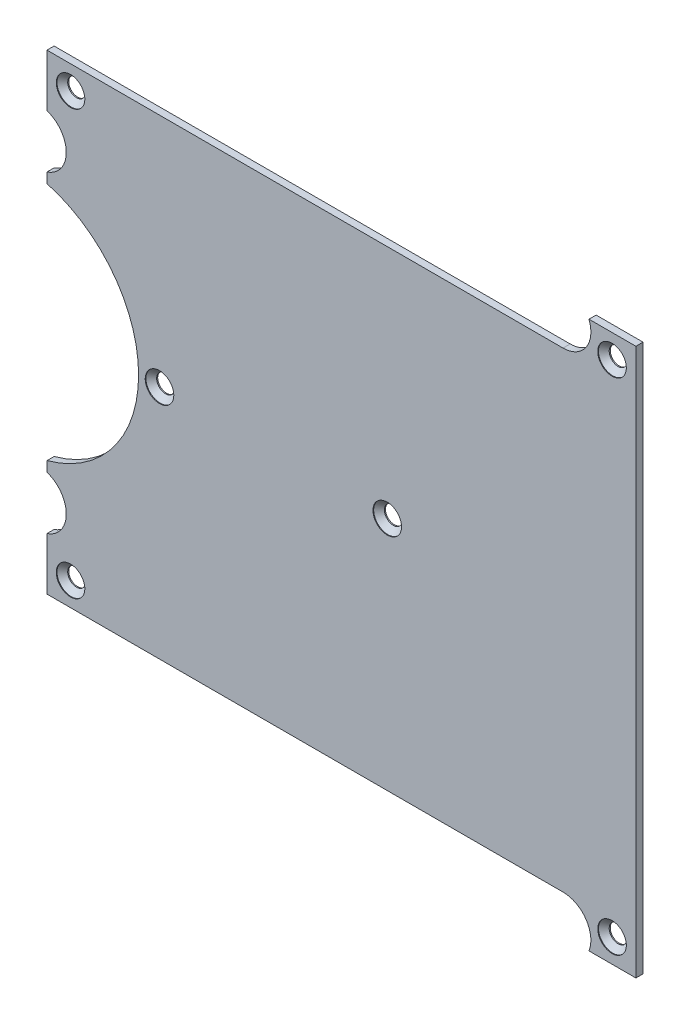
ISO-10303-21;
HEADER;
FILE_DESCRIPTION(('STEP AP214'),'2;1');
FILE_NAME('part.step','',(''),(''),'','','');
FILE_SCHEMA(('AUTOMOTIVE_DESIGN { 1 0 10303 214 1 1 1 1 }'));
ENDSEC;
DATA;
#1=APPLICATION_CONTEXT('core data for automotive mechanical design processes');
#2=APPLICATION_PROTOCOL_DEFINITION('international standard','automotive_design',2000,#1);
#3=PRODUCT_CONTEXT('',#1,'mechanical');
#4=PRODUCT('Part','Part','',(#3));
#5=PRODUCT_RELATED_PRODUCT_CATEGORY('part','',(#4));
#6=PRODUCT_DEFINITION_FORMATION('','',#4);
#7=PRODUCT_DEFINITION_CONTEXT('part definition',#1,'design');
#8=PRODUCT_DEFINITION('design','',#6,#7);
#9=PRODUCT_DEFINITION_SHAPE('','',#8);
#10=(LENGTH_UNIT() NAMED_UNIT(*) SI_UNIT(.MILLI.,.METRE.));
#11=(NAMED_UNIT(*) PLANE_ANGLE_UNIT() SI_UNIT($,.RADIAN.));
#12=(NAMED_UNIT(*) SI_UNIT($,.STERADIAN.) SOLID_ANGLE_UNIT());
#13=UNCERTAINTY_MEASURE_WITH_UNIT(LENGTH_MEASURE(1.E-05),#10,'distance_accuracy_value','');
#14=(GEOMETRIC_REPRESENTATION_CONTEXT(3) GLOBAL_UNCERTAINTY_ASSIGNED_CONTEXT((#13)) GLOBAL_UNIT_ASSIGNED_CONTEXT((#10,
#11,#12)) REPRESENTATION_CONTEXT('',''));
#15=CARTESIAN_POINT('',(0.,0.,0.));
#16=DIRECTION('',(0.,0.,1.));
#17=DIRECTION('',(1.,0.,0.));
#18=AXIS2_PLACEMENT_3D('',#15,#16,#17);
#19=CARTESIAN_POINT('',(0.,-36.88,1.));
#20=DIRECTION('',(0.,0.,1.));
#21=DIRECTION('',(1.,0.,0.));
#22=AXIS2_PLACEMENT_3D('',#19,#20,#21);
#23=PLANE('',#22);
#24=CARTESIAN_POINT('',(-68.9520251592834,29.68,1.));
#25=DIRECTION('',(0.,0.,1.));
#26=DIRECTION('',(1.,0.,0.));
#27=AXIS2_PLACEMENT_3D('',#24,#25,#26);
#28=CIRCLE('',#27,2.);
#29=CARTESIAN_POINT('',(-66.9520251592834,29.68,1.));
#30=VERTEX_POINT('',#29);
#31=EDGE_CURVE('E488',#30,#30,#28,.T.);
#32=ORIENTED_EDGE('',*,*,#31,.F.);
#33=EDGE_LOOP('',(#32));
#34=FACE_BOUND('',#33,.T.);
#35=CARTESIAN_POINT('',(6.86324983090334,35.,1.));
#36=DIRECTION('',(0.,0.,1.));
#37=DIRECTION('',(1.,0.,0.));
#38=AXIS2_PLACEMENT_3D('',#35,#36,#37);
#39=CIRCLE('',#38,2.);
#40=CARTESIAN_POINT('',(8.86324983090334,35.,1.));
#41=VERTEX_POINT('',#40);
#42=EDGE_CURVE('E296',#41,#41,#39,.T.);
#43=ORIENTED_EDGE('',*,*,#42,.F.);
#44=EDGE_LOOP('',(#43));
#45=FACE_BOUND('',#44,.T.);
#46=CARTESIAN_POINT('',(6.86324983090334,-35.,1.));
#47=DIRECTION('',(0.,0.,1.));
#48=DIRECTION('',(1.,0.,0.));
#49=AXIS2_PLACEMENT_3D('',#46,#47,#48);
#50=CIRCLE('',#49,2.);
#51=CARTESIAN_POINT('',(8.86324983090334,-35.,1.));
#52=VERTEX_POINT('',#51);
#53=EDGE_CURVE('E287',#52,#52,#50,.T.);
#54=ORIENTED_EDGE('',*,*,#53,.F.);
#55=EDGE_LOOP('',(#54));
#56=FACE_BOUND('',#55,.T.);
#57=CARTESIAN_POINT('',(-68.9520251592834,-29.68,1.));
#58=DIRECTION('',(0.,0.,1.));
#59=DIRECTION('',(1.,0.,0.));
#60=AXIS2_PLACEMENT_3D('',#57,#58,#59);
#61=CIRCLE('',#60,2.);
#62=CARTESIAN_POINT('',(-66.9520251592834,-29.68,1.));
#63=VERTEX_POINT('',#62);
#64=EDGE_CURVE('E282',#63,#63,#61,.T.);
#65=ORIENTED_EDGE('',*,*,#64,.F.);
#66=EDGE_LOOP('',(#65));
#67=FACE_BOUND('',#66,.T.);
#68=CARTESIAN_POINT('',(-56.4970251592834,0.,1.));
#69=DIRECTION('',(0.,0.,1.));
#70=DIRECTION('',(1.,0.,0.));
#71=AXIS2_PLACEMENT_3D('',#68,#69,#70);
#72=CIRCLE('',#71,2.);
#73=CARTESIAN_POINT('',(-54.4970251592834,0.,1.));
#74=VERTEX_POINT('',#73);
#75=EDGE_CURVE('E277',#74,#74,#72,.T.);
#76=ORIENTED_EDGE('',*,*,#75,.F.);
#77=EDGE_LOOP('',(#76));
#78=FACE_BOUND('',#77,.T.);
#79=CARTESIAN_POINT('',(-24.6110125796417,0.,1.));
#80=DIRECTION('',(0.,0.,1.));
#81=DIRECTION('',(1.,0.,0.));
#82=AXIS2_PLACEMENT_3D('',#79,#80,#81);
#83=CIRCLE('',#82,2.);
#84=CARTESIAN_POINT('',(-22.6110125796417,0.,1.));
#85=VERTEX_POINT('',#84);
#86=EDGE_CURVE('E271',#85,#85,#83,.T.);
#87=ORIENTED_EDGE('',*,*,#86,.F.);
#88=EDGE_LOOP('',(#87));
#89=FACE_BOUND('',#88,.T.);
#90=CARTESIAN_POINT('',(0.,-36.88,1.));
#91=DIRECTION('',(0.,0.,-1.));
#92=DIRECTION('',(1.,0.,0.));
#93=AXIS2_PLACEMENT_3D('',#90,#91,#92);
#94=CIRCLE('',#93,3.90000000000011);
#95=CARTESIAN_POINT('',(0.,-32.98,1.));
#96=VERTEX_POINT('',#95);
#97=CARTESIAN_POINT('',(3.63229954711911,-38.3,1.));
#98=VERTEX_POINT('',#97);
#99=EDGE_CURVE('E219',#96,#98,#94,.T.);
#100=ORIENTED_EDGE('',*,*,#99,.T.);
#101=DIRECTION('',(1.,0.,0.));
#102=VECTOR('',#101,1.);
#103=CARTESIAN_POINT('',(3.63229954711911,-38.3,1.));
#104=LINE('',#103,#102);
#105=CARTESIAN_POINT('',(10.2,-38.3,1.));
#106=VERTEX_POINT('',#105);
#107=EDGE_CURVE('E120',#98,#106,#104,.T.);
#108=ORIENTED_EDGE('',*,*,#107,.T.);
#109=DIRECTION('',(0.,1.,0.));
#110=VECTOR('',#109,1.);
#111=CARTESIAN_POINT('',(10.2,-38.3,1.));
#112=LINE('',#111,#110);
#113=CARTESIAN_POINT('',(10.2,38.3,1.));
#114=VERTEX_POINT('',#113);
#115=EDGE_CURVE('E352',#106,#114,#112,.T.);
#116=ORIENTED_EDGE('',*,*,#115,.T.);
#117=DIRECTION('',(-1.,0.,0.));
#118=VECTOR('',#117,1.);
#119=CARTESIAN_POINT('',(10.2,38.3,1.));
#120=LINE('',#119,#118);
#121=CARTESIAN_POINT('',(3.63229954711911,38.3,1.));
#122=VERTEX_POINT('',#121);
#123=EDGE_CURVE('E355',#114,#122,#120,.T.);
#124=ORIENTED_EDGE('',*,*,#123,.T.);
#125=CARTESIAN_POINT('',(0.,36.88,1.));
#126=DIRECTION('',(0.,0.,-1.));
#127=DIRECTION('',(1.,0.,0.));
#128=AXIS2_PLACEMENT_3D('',#125,#126,#127);
#129=CIRCLE('',#128,3.90000000000011);
#130=CARTESIAN_POINT('',(0.,32.9799999999999,1.));
#131=VERTEX_POINT('',#130);
#132=EDGE_CURVE('E358',#122,#131,#129,.T.);
#133=ORIENTED_EDGE('',*,*,#132,.T.);
#134=DIRECTION('',(-1.,0.,0.));
#135=VECTOR('',#134,1.);
#136=CARTESIAN_POINT('',(0.,32.98,1.));
#137=LINE('',#136,#135);
#138=CARTESIAN_POINT('',(-72.2520251592834,32.98,1.));
#139=VERTEX_POINT('',#138);
#140=EDGE_CURVE('E361',#131,#139,#137,.T.);
#141=ORIENTED_EDGE('',*,*,#140,.T.);
#142=DIRECTION('',(0.,-1.,0.));
#143=VECTOR('',#142,1.);
#144=CARTESIAN_POINT('',(-72.2520251592834,32.98,1.));
#145=LINE('',#144,#143);
#146=CARTESIAN_POINT('',(-72.2520251592834,25.6307950630559,1.));
#147=VERTEX_POINT('',#146);
#148=EDGE_CURVE('E364',#139,#147,#145,.T.);
#149=ORIENTED_EDGE('',*,*,#148,.T.);
#150=CARTESIAN_POINT('',(-73.4520251592834,21.92,1.));
#151=DIRECTION('',(0.,0.,-1.));
#152=DIRECTION('',(1.,0.,0.));
#153=AXIS2_PLACEMENT_3D('',#150,#151,#152);
#154=CIRCLE('',#153,3.89999999999999);
#155=CARTESIAN_POINT('',(-72.2520251592834,18.2092049369441,1.));
#156=VERTEX_POINT('',#155);
#157=EDGE_CURVE('E367',#147,#156,#154,.T.);
#158=ORIENTED_EDGE('',*,*,#157,.T.);
#159=DIRECTION('',(0.,-1.,0.));
#160=VECTOR('',#159,1.);
#161=CARTESIAN_POINT('',(-72.2520251592834,18.2092049369441,1.));
#162=LINE('',#161,#160);
#163=CARTESIAN_POINT('',(-72.2520251592834,16.7891363684973,1.));
#164=VERTEX_POINT('',#163);
#165=EDGE_CURVE('E370',#156,#164,#162,.T.);
#166=ORIENTED_EDGE('',*,*,#165,.T.);
#167=CARTESIAN_POINT('',(-76.8220251592834,0.,1.));
#168=DIRECTION('',(0.,0.,-1.));
#169=DIRECTION('',(1.,0.,0.));
#170=AXIS2_PLACEMENT_3D('',#167,#168,#169);
#171=CIRCLE('',#170,17.4);
#172=CARTESIAN_POINT('',(-72.2520251592834,-16.7891363684973,1.));
#173=VERTEX_POINT('',#172);
#174=EDGE_CURVE('E373',#164,#173,#171,.T.);
#175=ORIENTED_EDGE('',*,*,#174,.T.);
#176=DIRECTION('',(0.,-1.,0.));
#177=VECTOR('',#176,1.);
#178=CARTESIAN_POINT('',(-72.2520251592834,-16.7891363684973,1.));
#179=LINE('',#178,#177);
#180=CARTESIAN_POINT('',(-72.2520251592834,-18.2092049369441,1.));
#181=VERTEX_POINT('',#180);
#182=EDGE_CURVE('E156',#173,#181,#179,.T.);
#183=ORIENTED_EDGE('',*,*,#182,.T.);
#184=CARTESIAN_POINT('',(-73.4520251592834,-21.92,1.));
#185=DIRECTION('',(0.,0.,-1.));
#186=DIRECTION('',(1.,0.,0.));
#187=AXIS2_PLACEMENT_3D('',#184,#185,#186);
#188=CIRCLE('',#187,3.89999999999999);
#189=CARTESIAN_POINT('',(-72.2520251592834,-25.6307950630559,1.));
#190=VERTEX_POINT('',#189);
#191=EDGE_CURVE('E151',#181,#190,#188,.T.);
#192=ORIENTED_EDGE('',*,*,#191,.T.);
#193=DIRECTION('',(0.,-1.,0.));
#194=VECTOR('',#193,1.);
#195=CARTESIAN_POINT('',(-72.2520251592834,-25.6307950630559,1.));
#196=LINE('',#195,#194);
#197=CARTESIAN_POINT('',(-72.2520251592834,-32.98,1.));
#198=VERTEX_POINT('',#197);
#199=EDGE_CURVE('E154',#190,#198,#196,.T.);
#200=ORIENTED_EDGE('',*,*,#199,.T.);
#201=DIRECTION('',(1.,0.,0.));
#202=VECTOR('',#201,1.);
#203=CARTESIAN_POINT('',(-72.2520251592834,-32.98,1.));
#204=LINE('',#203,#202);
#205=EDGE_CURVE('E59',#198,#96,#204,.T.);
#206=ORIENTED_EDGE('',*,*,#205,.T.);
#207=EDGE_LOOP('',(#100,#108,#116,#124,#133,#141,#149,#158,#166,#175,#183,#192,#200,#206));
#208=FACE_BOUND('',#207,.T.);
#209=ADVANCED_FACE('F39',(#34,#45,#56,#67,#78,#89,#208),#23,.T.);
#210=CARTESIAN_POINT('',(0.,-36.88,0.));
#211=DIRECTION('',(0.,0.,1.));
#212=DIRECTION('',(1.,0.,0.));
#213=AXIS2_PLACEMENT_3D('',#210,#211,#212);
#214=PLANE('',#213);
#215=CARTESIAN_POINT('',(0.,-36.88,0.));
#216=DIRECTION('',(0.,0.,-1.));
#217=DIRECTION('',(1.,0.,0.));
#218=AXIS2_PLACEMENT_3D('',#215,#216,#217);
#219=CIRCLE('',#218,3.90000000000011);
#220=CARTESIAN_POINT('',(0.,-32.98,0.));
#221=VERTEX_POINT('',#220);
#222=CARTESIAN_POINT('',(3.63229954711911,-38.3,0.));
#223=VERTEX_POINT('',#222);
#224=EDGE_CURVE('E178',#221,#223,#219,.T.);
#225=ORIENTED_EDGE('',*,*,#224,.F.);
#226=DIRECTION('',(1.,0.,0.));
#227=VECTOR('',#226,1.);
#228=CARTESIAN_POINT('',(-72.2520251592834,-32.98,0.));
#229=LINE('',#228,#227);
#230=CARTESIAN_POINT('',(-72.2520251592834,-32.98,0.));
#231=VERTEX_POINT('',#230);
#232=EDGE_CURVE('E112',#231,#221,#229,.T.);
#233=ORIENTED_EDGE('',*,*,#232,.F.);
#234=DIRECTION('',(0.,-1.,0.));
#235=VECTOR('',#234,1.);
#236=CARTESIAN_POINT('',(-72.2520251592834,-25.6307950630559,0.));
#237=LINE('',#236,#235);
#238=CARTESIAN_POINT('',(-72.2520251592834,-25.6307950630559,0.));
#239=VERTEX_POINT('',#238);
#240=EDGE_CURVE('E106',#239,#231,#237,.T.);
#241=ORIENTED_EDGE('',*,*,#240,.F.);
#242=CARTESIAN_POINT('',(-73.4520251592834,-21.92,0.));
#243=DIRECTION('',(0.,0.,-1.));
#244=DIRECTION('',(1.,0.,0.));
#245=AXIS2_PLACEMENT_3D('',#242,#243,#244);
#246=CIRCLE('',#245,3.89999999999999);
#247=CARTESIAN_POINT('',(-72.2520251592834,-18.2092049369441,0.));
#248=VERTEX_POINT('',#247);
#249=EDGE_CURVE('E165',#248,#239,#246,.T.);
#250=ORIENTED_EDGE('',*,*,#249,.F.);
#251=DIRECTION('',(0.,-1.,0.));
#252=VECTOR('',#251,1.);
#253=CARTESIAN_POINT('',(-72.2520251592834,-16.7891363684973,0.));
#254=LINE('',#253,#252);
#255=CARTESIAN_POINT('',(-72.2520251592834,-16.7891363684973,0.));
#256=VERTEX_POINT('',#255);
#257=EDGE_CURVE('E210',#256,#248,#254,.T.);
#258=ORIENTED_EDGE('',*,*,#257,.F.);
#259=CARTESIAN_POINT('',(-76.8220251592834,0.,0.));
#260=DIRECTION('',(0.,0.,-1.));
#261=DIRECTION('',(1.,0.,0.));
#262=AXIS2_PLACEMENT_3D('',#259,#260,#261);
#263=CIRCLE('',#262,17.4);
#264=CARTESIAN_POINT('',(-72.2520251592834,16.7891363684973,0.));
#265=VERTEX_POINT('',#264);
#266=EDGE_CURVE('E207',#265,#256,#263,.T.);
#267=ORIENTED_EDGE('',*,*,#266,.F.);
#268=DIRECTION('',(0.,-1.,0.));
#269=VECTOR('',#268,1.);
#270=CARTESIAN_POINT('',(-72.2520251592834,18.2092049369441,0.));
#271=LINE('',#270,#269);
#272=CARTESIAN_POINT('',(-72.2520251592834,18.2092049369441,0.));
#273=VERTEX_POINT('',#272);
#274=EDGE_CURVE('E204',#273,#265,#271,.T.);
#275=ORIENTED_EDGE('',*,*,#274,.F.);
#276=CARTESIAN_POINT('',(-73.4520251592834,21.92,0.));
#277=DIRECTION('',(0.,0.,-1.));
#278=DIRECTION('',(1.,0.,0.));
#279=AXIS2_PLACEMENT_3D('',#276,#277,#278);
#280=CIRCLE('',#279,3.89999999999999);
#281=CARTESIAN_POINT('',(-72.2520251592834,25.6307950630559,0.));
#282=VERTEX_POINT('',#281);
#283=EDGE_CURVE('E201',#282,#273,#280,.T.);
#284=ORIENTED_EDGE('',*,*,#283,.F.);
#285=DIRECTION('',(0.,-1.,0.));
#286=VECTOR('',#285,1.);
#287=CARTESIAN_POINT('',(-72.2520251592834,32.98,0.));
#288=LINE('',#287,#286);
#289=CARTESIAN_POINT('',(-72.2520251592834,32.98,0.));
#290=VERTEX_POINT('',#289);
#291=EDGE_CURVE('E198',#290,#282,#288,.T.);
#292=ORIENTED_EDGE('',*,*,#291,.F.);
#293=DIRECTION('',(-1.,0.,0.));
#294=VECTOR('',#293,1.);
#295=CARTESIAN_POINT('',(0.,32.98,0.));
#296=LINE('',#295,#294);
#297=CARTESIAN_POINT('',(0.,32.9799999999999,0.));
#298=VERTEX_POINT('',#297);
#299=EDGE_CURVE('E195',#298,#290,#296,.T.);
#300=ORIENTED_EDGE('',*,*,#299,.F.);
#301=CARTESIAN_POINT('',(0.,36.88,0.));
#302=DIRECTION('',(0.,0.,-1.));
#303=DIRECTION('',(1.,0.,0.));
#304=AXIS2_PLACEMENT_3D('',#301,#302,#303);
#305=CIRCLE('',#304,3.90000000000011);
#306=CARTESIAN_POINT('',(3.63229954711911,38.3,0.));
#307=VERTEX_POINT('',#306);
#308=EDGE_CURVE('E192',#307,#298,#305,.T.);
#309=ORIENTED_EDGE('',*,*,#308,.F.);
#310=DIRECTION('',(-1.,0.,0.));
#311=VECTOR('',#310,1.);
#312=CARTESIAN_POINT('',(10.2,38.3,0.));
#313=LINE('',#312,#311);
#314=CARTESIAN_POINT('',(10.2,38.3,0.));
#315=VERTEX_POINT('',#314);
#316=EDGE_CURVE('E189',#315,#307,#313,.T.);
#317=ORIENTED_EDGE('',*,*,#316,.F.);
#318=DIRECTION('',(0.,1.,0.));
#319=VECTOR('',#318,1.);
#320=CARTESIAN_POINT('',(10.2,-38.3,0.));
#321=LINE('',#320,#319);
#322=CARTESIAN_POINT('',(10.2,-38.3,0.));
#323=VERTEX_POINT('',#322);
#324=EDGE_CURVE('E186',#323,#315,#321,.T.);
#325=ORIENTED_EDGE('',*,*,#324,.F.);
#326=DIRECTION('',(1.,0.,0.));
#327=VECTOR('',#326,1.);
#328=CARTESIAN_POINT('',(3.63229954711911,-38.3,0.));
#329=LINE('',#328,#327);
#330=EDGE_CURVE('E182',#223,#323,#329,.T.);
#331=ORIENTED_EDGE('',*,*,#330,.F.);
#332=EDGE_LOOP('',(#225,#233,#241,#250,#258,#267,#275,#284,#292,#300,#309,#317,#325,#331));
#333=FACE_BOUND('',#332,.T.);
#334=CARTESIAN_POINT('',(-68.9520251592834,29.68,0.));
#335=DIRECTION('',(0.,0.,1.));
#336=DIRECTION('',(1.,0.,0.));
#337=AXIS2_PLACEMENT_3D('',#334,#335,#336);
#338=CIRCLE('',#337,1.25);
#339=CARTESIAN_POINT('',(-67.7020251592834,29.68,0.));
#340=VERTEX_POINT('',#339);
#341=EDGE_CURVE('E183',#340,#340,#338,.T.);
#342=ORIENTED_EDGE('',*,*,#341,.T.);
#343=EDGE_LOOP('',(#342));
#344=FACE_BOUND('',#343,.T.);
#345=CARTESIAN_POINT('',(6.86324983090334,35.,0.));
#346=DIRECTION('',(0.,0.,1.));
#347=DIRECTION('',(1.,0.,0.));
#348=AXIS2_PLACEMENT_3D('',#345,#346,#347);
#349=CIRCLE('',#348,1.25);
#350=CARTESIAN_POINT('',(8.11324983090334,35.,0.));
#351=VERTEX_POINT('',#350);
#352=EDGE_CURVE('E341',#351,#351,#349,.T.);
#353=ORIENTED_EDGE('',*,*,#352,.T.);
#354=EDGE_LOOP('',(#353));
#355=FACE_BOUND('',#354,.T.);
#356=CARTESIAN_POINT('',(6.86324983090334,-35.,0.));
#357=DIRECTION('',(0.,0.,1.));
#358=DIRECTION('',(1.,0.,0.));
#359=AXIS2_PLACEMENT_3D('',#356,#357,#358);
#360=CIRCLE('',#359,1.25);
#361=CARTESIAN_POINT('',(8.11324983090334,-35.,0.));
#362=VERTEX_POINT('',#361);
#363=EDGE_CURVE('E337',#362,#362,#360,.T.);
#364=ORIENTED_EDGE('',*,*,#363,.T.);
#365=EDGE_LOOP('',(#364));
#366=FACE_BOUND('',#365,.T.);
#367=CARTESIAN_POINT('',(-68.9520251592834,-29.68,0.));
#368=DIRECTION('',(0.,0.,1.));
#369=DIRECTION('',(1.,0.,0.));
#370=AXIS2_PLACEMENT_3D('',#367,#368,#369);
#371=CIRCLE('',#370,1.25);
#372=CARTESIAN_POINT('',(-67.7020251592834,-29.68,0.));
#373=VERTEX_POINT('',#372);
#374=EDGE_CURVE('E333',#373,#373,#371,.T.);
#375=ORIENTED_EDGE('',*,*,#374,.T.);
#376=EDGE_LOOP('',(#375));
#377=FACE_BOUND('',#376,.T.);
#378=CARTESIAN_POINT('',(-56.4970251592834,0.,0.));
#379=DIRECTION('',(0.,0.,1.));
#380=DIRECTION('',(1.,0.,0.));
#381=AXIS2_PLACEMENT_3D('',#378,#379,#380);
#382=CIRCLE('',#381,1.25);
#383=CARTESIAN_POINT('',(-55.2470251592834,0.,0.));
#384=VERTEX_POINT('',#383);
#385=EDGE_CURVE('E329',#384,#384,#382,.T.);
#386=ORIENTED_EDGE('',*,*,#385,.T.);
#387=EDGE_LOOP('',(#386));
#388=FACE_BOUND('',#387,.T.);
#389=CARTESIAN_POINT('',(-24.6110125796417,0.,0.));
#390=DIRECTION('',(0.,0.,1.));
#391=DIRECTION('',(1.,0.,0.));
#392=AXIS2_PLACEMENT_3D('',#389,#390,#391);
#393=CIRCLE('',#392,1.25);
#394=CARTESIAN_POINT('',(-23.3610125796417,0.,0.));
#395=VERTEX_POINT('',#394);
#396=EDGE_CURVE('E265',#395,#395,#393,.T.);
#397=ORIENTED_EDGE('',*,*,#396,.T.);
#398=EDGE_LOOP('',(#397));
#399=FACE_BOUND('',#398,.T.);
#400=ADVANCED_FACE('F388',(#333,#344,#355,#366,#377,#388,#399),#214,.F.);
#401=CARTESIAN_POINT('',(0.,-36.88,1.));
#402=DIRECTION('',(0.,0.,-1.));
#403=DIRECTION('',(-1.,0.,0.));
#404=AXIS2_PLACEMENT_3D('',#401,#402,#403);
#405=CYLINDRICAL_SURFACE('',#404,3.90000000000011);
#406=ORIENTED_EDGE('',*,*,#224,.T.);
#407=DIRECTION('',(0.,0.,-1.));
#408=VECTOR('',#407,1.);
#409=CARTESIAN_POINT('',(3.63229954711911,-38.3,1.));
#410=LINE('',#409,#408);
#411=EDGE_CURVE('E11',#98,#223,#410,.T.);
#412=ORIENTED_EDGE('',*,*,#411,.F.);
#413=ORIENTED_EDGE('',*,*,#99,.F.);
#414=DIRECTION('',(0.,0.,-1.));
#415=VECTOR('',#414,1.);
#416=CARTESIAN_POINT('',(0.,-32.98,1.));
#417=LINE('',#416,#415);
#418=EDGE_CURVE('E174',#96,#221,#417,.T.);
#419=ORIENTED_EDGE('',*,*,#418,.T.);
#420=EDGE_LOOP('',(#406,#412,#413,#419));
#421=FACE_BOUND('',#420,.T.);
#422=ADVANCED_FACE('F41',(#421),#405,.F.);
#423=CARTESIAN_POINT('',(3.63229954711911,-38.3,1.));
#424=DIRECTION('',(0.,1.,0.));
#425=DIRECTION('',(0.,0.,1.));
#426=AXIS2_PLACEMENT_3D('',#423,#424,#425);
#427=PLANE('',#426);
#428=ORIENTED_EDGE('',*,*,#330,.T.);
#429=DIRECTION('',(0.,0.,-1.));
#430=VECTOR('',#429,1.);
#431=CARTESIAN_POINT('',(10.2,-38.3,1.));
#432=LINE('',#431,#430);
#433=EDGE_CURVE('E50',#106,#323,#432,.T.);
#434=ORIENTED_EDGE('',*,*,#433,.F.);
#435=ORIENTED_EDGE('',*,*,#107,.F.);
#436=ORIENTED_EDGE('',*,*,#411,.T.);
#437=EDGE_LOOP('',(#428,#434,#435,#436));
#438=FACE_BOUND('',#437,.T.);
#439=ADVANCED_FACE('F690',(#438),#427,.F.);
#440=CARTESIAN_POINT('',(10.2,-38.3,1.));
#441=DIRECTION('',(-1.,0.,0.));
#442=DIRECTION('',(0.,0.,1.));
#443=AXIS2_PLACEMENT_3D('',#440,#441,#442);
#444=PLANE('',#443);
#445=ORIENTED_EDGE('',*,*,#324,.T.);
#446=DIRECTION('',(0.,0.,-1.));
#447=VECTOR('',#446,1.);
#448=CARTESIAN_POINT('',(10.2,38.3,1.));
#449=LINE('',#448,#447);
#450=EDGE_CURVE('E254',#114,#315,#449,.T.);
#451=ORIENTED_EDGE('',*,*,#450,.F.);
#452=ORIENTED_EDGE('',*,*,#115,.F.);
#453=ORIENTED_EDGE('',*,*,#433,.T.);
#454=EDGE_LOOP('',(#445,#451,#452,#453));
#455=FACE_BOUND('',#454,.T.);
#456=ADVANCED_FACE('F680',(#455),#444,.F.);
#457=CARTESIAN_POINT('',(10.2,38.3,1.));
#458=DIRECTION('',(0.,-1.,0.));
#459=DIRECTION('',(0.,0.,-1.));
#460=AXIS2_PLACEMENT_3D('',#457,#458,#459);
#461=PLANE('',#460);
#462=ORIENTED_EDGE('',*,*,#316,.T.);
#463=DIRECTION('',(0.,0.,-1.));
#464=VECTOR('',#463,1.);
#465=CARTESIAN_POINT('',(3.63229954711911,38.3,1.));
#466=LINE('',#465,#464);
#467=EDGE_CURVE('E250',#122,#307,#466,.T.);
#468=ORIENTED_EDGE('',*,*,#467,.F.);
#469=ORIENTED_EDGE('',*,*,#123,.F.);
#470=ORIENTED_EDGE('',*,*,#450,.T.);
#471=EDGE_LOOP('',(#462,#468,#469,#470));
#472=FACE_BOUND('',#471,.T.);
#473=ADVANCED_FACE('F670',(#472),#461,.F.);
#474=CARTESIAN_POINT('',(0.,36.88,1.));
#475=DIRECTION('',(0.,0.,-1.));
#476=DIRECTION('',(-1.,0.,0.));
#477=AXIS2_PLACEMENT_3D('',#474,#475,#476);
#478=CYLINDRICAL_SURFACE('',#477,3.90000000000011);
#479=ORIENTED_EDGE('',*,*,#308,.T.);
#480=DIRECTION('',(0.,0.,-1.));
#481=VECTOR('',#480,1.);
#482=CARTESIAN_POINT('',(0.,32.9799999999999,1.));
#483=LINE('',#482,#481);
#484=EDGE_CURVE('E246',#131,#298,#483,.T.);
#485=ORIENTED_EDGE('',*,*,#484,.F.);
#486=ORIENTED_EDGE('',*,*,#132,.F.);
#487=ORIENTED_EDGE('',*,*,#467,.T.);
#488=EDGE_LOOP('',(#479,#485,#486,#487));
#489=FACE_BOUND('',#488,.T.);
#490=ADVANCED_FACE('F660',(#489),#478,.F.);
#491=CARTESIAN_POINT('',(0.,32.98,1.));
#492=DIRECTION('',(0.,-1.,0.));
#493=DIRECTION('',(1.,0.,0.));
#494=AXIS2_PLACEMENT_3D('',#491,#492,#493);
#495=PLANE('',#494);
#496=ORIENTED_EDGE('',*,*,#299,.T.);
#497=DIRECTION('',(0.,0.,-1.));
#498=VECTOR('',#497,1.);
#499=CARTESIAN_POINT('',(-72.2520251592834,32.98,1.));
#500=LINE('',#499,#498);
#501=EDGE_CURVE('E242',#139,#290,#500,.T.);
#502=ORIENTED_EDGE('',*,*,#501,.F.);
#503=ORIENTED_EDGE('',*,*,#140,.F.);
#504=ORIENTED_EDGE('',*,*,#484,.T.);
#505=EDGE_LOOP('',(#496,#502,#503,#504));
#506=FACE_BOUND('',#505,.T.);
#507=ADVANCED_FACE('F650',(#506),#495,.F.);
#508=CARTESIAN_POINT('',(-72.2520251592834,32.98,1.));
#509=DIRECTION('',(1.,0.,0.));
#510=DIRECTION('',(0.,1.,0.));
#511=AXIS2_PLACEMENT_3D('',#508,#509,#510);
#512=PLANE('',#511);
#513=ORIENTED_EDGE('',*,*,#291,.T.);
#514=DIRECTION('',(0.,0.,-1.));
#515=VECTOR('',#514,1.);
#516=CARTESIAN_POINT('',(-72.2520251592834,25.6307950630559,1.));
#517=LINE('',#516,#515);
#518=EDGE_CURVE('E238',#147,#282,#517,.T.);
#519=ORIENTED_EDGE('',*,*,#518,.F.);
#520=ORIENTED_EDGE('',*,*,#148,.F.);
#521=ORIENTED_EDGE('',*,*,#501,.T.);
#522=EDGE_LOOP('',(#513,#519,#520,#521));
#523=FACE_BOUND('',#522,.T.);
#524=ADVANCED_FACE('F640',(#523),#512,.F.);
#525=CARTESIAN_POINT('',(-73.4520251592834,21.92,1.));
#526=DIRECTION('',(0.,0.,-1.));
#527=DIRECTION('',(-1.,0.,0.));
#528=AXIS2_PLACEMENT_3D('',#525,#526,#527);
#529=CYLINDRICAL_SURFACE('',#528,3.89999999999999);
#530=ORIENTED_EDGE('',*,*,#283,.T.);
#531=DIRECTION('',(0.,0.,-1.));
#532=VECTOR('',#531,1.);
#533=CARTESIAN_POINT('',(-72.2520251592834,18.2092049369441,1.));
#534=LINE('',#533,#532);
#535=EDGE_CURVE('E234',#156,#273,#534,.T.);
#536=ORIENTED_EDGE('',*,*,#535,.F.);
#537=ORIENTED_EDGE('',*,*,#157,.F.);
#538=ORIENTED_EDGE('',*,*,#518,.T.);
#539=EDGE_LOOP('',(#530,#536,#537,#538));
#540=FACE_BOUND('',#539,.T.);
#541=ADVANCED_FACE('F630',(#540),#529,.F.);
#542=CARTESIAN_POINT('',(-72.2520251592834,18.2092049369441,1.));
#543=DIRECTION('',(1.,0.,0.));
#544=DIRECTION('',(0.,1.,0.));
#545=AXIS2_PLACEMENT_3D('',#542,#543,#544);
#546=PLANE('',#545);
#547=ORIENTED_EDGE('',*,*,#274,.T.);
#548=DIRECTION('',(0.,0.,-1.));
#549=VECTOR('',#548,1.);
#550=CARTESIAN_POINT('',(-72.2520251592834,16.7891363684973,1.));
#551=LINE('',#550,#549);
#552=EDGE_CURVE('E230',#164,#265,#551,.T.);
#553=ORIENTED_EDGE('',*,*,#552,.F.);
#554=ORIENTED_EDGE('',*,*,#165,.F.);
#555=ORIENTED_EDGE('',*,*,#535,.T.);
#556=EDGE_LOOP('',(#547,#553,#554,#555));
#557=FACE_BOUND('',#556,.T.);
#558=ADVANCED_FACE('F621',(#557),#546,.F.);
#559=CARTESIAN_POINT('',(-76.8220251592834,0.,1.));
#560=DIRECTION('',(0.,0.,-1.));
#561=DIRECTION('',(-1.,0.,0.));
#562=AXIS2_PLACEMENT_3D('',#559,#560,#561);
#563=CYLINDRICAL_SURFACE('',#562,17.4);
#564=ORIENTED_EDGE('',*,*,#266,.T.);
#565=DIRECTION('',(0.,0.,-1.));
#566=VECTOR('',#565,1.);
#567=CARTESIAN_POINT('',(-72.2520251592834,-16.7891363684973,1.));
#568=LINE('',#567,#566);
#569=EDGE_CURVE('E226',#173,#256,#568,.T.);
#570=ORIENTED_EDGE('',*,*,#569,.F.);
#571=ORIENTED_EDGE('',*,*,#174,.F.);
#572=ORIENTED_EDGE('',*,*,#552,.T.);
#573=EDGE_LOOP('',(#564,#570,#571,#572));
#574=FACE_BOUND('',#573,.T.);
#575=ADVANCED_FACE('F381',(#574),#563,.F.);
#576=CARTESIAN_POINT('',(-72.2520251592834,-16.7891363684973,1.));
#577=DIRECTION('',(1.,0.,0.));
#578=DIRECTION('',(0.,1.,0.));
#579=AXIS2_PLACEMENT_3D('',#576,#577,#578);
#580=PLANE('',#579);
#581=ORIENTED_EDGE('',*,*,#257,.T.);
#582=DIRECTION('',(0.,0.,-1.));
#583=VECTOR('',#582,1.);
#584=CARTESIAN_POINT('',(-72.2520251592834,-18.2092049369441,1.));
#585=LINE('',#584,#583);
#586=EDGE_CURVE('E167',#181,#248,#585,.T.);
#587=ORIENTED_EDGE('',*,*,#586,.F.);
#588=ORIENTED_EDGE('',*,*,#182,.F.);
#589=ORIENTED_EDGE('',*,*,#569,.T.);
#590=EDGE_LOOP('',(#581,#587,#588,#589));
#591=FACE_BOUND('',#590,.T.);
#592=ADVANCED_FACE('F385',(#591),#580,.F.);
#593=CARTESIAN_POINT('',(-73.4520251592834,-21.92,1.));
#594=DIRECTION('',(0.,0.,-1.));
#595=DIRECTION('',(-1.,0.,0.));
#596=AXIS2_PLACEMENT_3D('',#593,#594,#595);
#597=CYLINDRICAL_SURFACE('',#596,3.89999999999999);
#598=ORIENTED_EDGE('',*,*,#249,.T.);
#599=DIRECTION('',(0.,0.,-1.));
#600=VECTOR('',#599,1.);
#601=CARTESIAN_POINT('',(-72.2520251592834,-25.6307950630559,1.));
#602=LINE('',#601,#600);
#603=EDGE_CURVE('E162',#190,#239,#602,.T.);
#604=ORIENTED_EDGE('',*,*,#603,.F.);
#605=ORIENTED_EDGE('',*,*,#191,.F.);
#606=ORIENTED_EDGE('',*,*,#586,.T.);
#607=EDGE_LOOP('',(#598,#604,#605,#606));
#608=FACE_BOUND('',#607,.T.);
#609=ADVANCED_FACE('F163',(#608),#597,.F.);
#610=CARTESIAN_POINT('',(-72.2520251592834,-25.6307950630559,1.));
#611=DIRECTION('',(1.,0.,0.));
#612=DIRECTION('',(0.,1.,0.));
#613=AXIS2_PLACEMENT_3D('',#610,#611,#612);
#614=PLANE('',#613);
#615=ORIENTED_EDGE('',*,*,#240,.T.);
#616=DIRECTION('',(0.,0.,-1.));
#617=VECTOR('',#616,1.);
#618=CARTESIAN_POINT('',(-72.2520251592834,-32.98,1.));
#619=LINE('',#618,#617);
#620=EDGE_CURVE('E168',#198,#231,#619,.T.);
#621=ORIENTED_EDGE('',*,*,#620,.F.);
#622=ORIENTED_EDGE('',*,*,#199,.F.);
#623=ORIENTED_EDGE('',*,*,#603,.T.);
#624=EDGE_LOOP('',(#615,#621,#622,#623));
#625=FACE_BOUND('',#624,.T.);
#626=ADVANCED_FACE('F170',(#625),#614,.F.);
#627=CARTESIAN_POINT('',(-72.2520251592834,-32.98,1.));
#628=DIRECTION('',(0.,1.,0.));
#629=DIRECTION('',(-1.,0.,0.));
#630=AXIS2_PLACEMENT_3D('',#627,#628,#629);
#631=PLANE('',#630);
#632=ORIENTED_EDGE('',*,*,#232,.T.);
#633=ORIENTED_EDGE('',*,*,#418,.F.);
#634=ORIENTED_EDGE('',*,*,#205,.F.);
#635=ORIENTED_EDGE('',*,*,#620,.T.);
#636=EDGE_LOOP('',(#632,#633,#634,#635));
#637=FACE_BOUND('',#636,.T.);
#638=ADVANCED_FACE('F394',(#637),#631,.F.);
#639=CARTESIAN_POINT('',(-68.9520251592834,29.68,1.));
#640=DIRECTION('',(0.,0.,-1.));
#641=DIRECTION('',(-1.,0.,0.));
#642=AXIS2_PLACEMENT_3D('',#639,#640,#641);
#643=CYLINDRICAL_SURFACE('',#642,1.25);
#644=CARTESIAN_POINT('',(-68.9520251592834,29.68,0.149999999999998));
#645=DIRECTION('',(0.,0.,1.));
#646=DIRECTION('',(1.,0.,0.));
#647=AXIS2_PLACEMENT_3D('',#644,#645,#646);
#648=CIRCLE('',#647,1.25);
#649=CARTESIAN_POINT('',(-67.7020251592834,29.68,0.149999999999998));
#650=VERTEX_POINT('',#649);
#651=EDGE_CURVE('E43',#650,#650,#648,.F.);
#652=ORIENTED_EDGE('',*,*,#651,.F.);
#653=EDGE_LOOP('',(#652));
#654=FACE_BOUND('',#653,.T.);
#655=ORIENTED_EDGE('',*,*,#341,.F.);
#656=EDGE_LOOP('',(#655));
#657=FACE_BOUND('',#656,.T.);
#658=ADVANCED_FACE('F396',(#654,#657),#643,.F.);
#659=CARTESIAN_POINT('',(6.86324983090334,35.,1.));
#660=DIRECTION('',(0.,0.,-1.));
#661=DIRECTION('',(-1.,0.,0.));
#662=AXIS2_PLACEMENT_3D('',#659,#660,#661);
#663=CYLINDRICAL_SURFACE('',#662,1.25);
#664=CARTESIAN_POINT('',(6.86324983090334,35.,0.150000000000002));
#665=DIRECTION('',(0.,0.,1.));
#666=DIRECTION('',(1.,0.,0.));
#667=AXIS2_PLACEMENT_3D('',#664,#665,#666);
#668=CIRCLE('',#667,1.25);
#669=CARTESIAN_POINT('',(8.11324983090334,35.,0.150000000000002));
#670=VERTEX_POINT('',#669);
#671=EDGE_CURVE('E284',#670,#670,#668,.F.);
#672=ORIENTED_EDGE('',*,*,#671,.F.);
#673=EDGE_LOOP('',(#672));
#674=FACE_BOUND('',#673,.T.);
#675=ORIENTED_EDGE('',*,*,#352,.F.);
#676=EDGE_LOOP('',(#675));
#677=FACE_BOUND('',#676,.T.);
#678=ADVANCED_FACE('F402',(#674,#677),#663,.F.);
#679=CARTESIAN_POINT('',(6.86324983090334,-35.,1.));
#680=DIRECTION('',(0.,0.,-1.));
#681=DIRECTION('',(-1.,0.,0.));
#682=AXIS2_PLACEMENT_3D('',#679,#680,#681);
#683=CYLINDRICAL_SURFACE('',#682,1.25);
#684=CARTESIAN_POINT('',(6.86324983090334,-35.,0.150000000000002));
#685=DIRECTION('',(0.,0.,1.));
#686=DIRECTION('',(1.,0.,0.));
#687=AXIS2_PLACEMENT_3D('',#684,#685,#686);
#688=CIRCLE('',#687,1.25);
#689=CARTESIAN_POINT('',(8.11324983090334,-35.,0.150000000000002));
#690=VERTEX_POINT('',#689);
#691=EDGE_CURVE('E279',#690,#690,#688,.F.);
#692=ORIENTED_EDGE('',*,*,#691,.F.);
#693=EDGE_LOOP('',(#692));
#694=FACE_BOUND('',#693,.T.);
#695=ORIENTED_EDGE('',*,*,#363,.F.);
#696=EDGE_LOOP('',(#695));
#697=FACE_BOUND('',#696,.T.);
#698=ADVANCED_FACE('F418',(#694,#697),#683,.F.);
#699=CARTESIAN_POINT('',(-68.9520251592834,-29.68,1.));
#700=DIRECTION('',(0.,0.,-1.));
#701=DIRECTION('',(-1.,0.,0.));
#702=AXIS2_PLACEMENT_3D('',#699,#700,#701);
#703=CYLINDRICAL_SURFACE('',#702,1.25);
#704=CARTESIAN_POINT('',(-68.9520251592834,-29.68,0.149999999999998));
#705=DIRECTION('',(0.,0.,1.));
#706=DIRECTION('',(1.,0.,0.));
#707=AXIS2_PLACEMENT_3D('',#704,#705,#706);
#708=CIRCLE('',#707,1.25);
#709=CARTESIAN_POINT('',(-67.7020251592834,-29.68,0.149999999999998));
#710=VERTEX_POINT('',#709);
#711=EDGE_CURVE('E273',#710,#710,#708,.F.);
#712=ORIENTED_EDGE('',*,*,#711,.F.);
#713=EDGE_LOOP('',(#712));
#714=FACE_BOUND('',#713,.T.);
#715=ORIENTED_EDGE('',*,*,#374,.F.);
#716=EDGE_LOOP('',(#715));
#717=FACE_BOUND('',#716,.T.);
#718=ADVANCED_FACE('F422',(#714,#717),#703,.F.);
#719=CARTESIAN_POINT('',(-56.4970251592834,0.,1.));
#720=DIRECTION('',(0.,0.,-1.));
#721=DIRECTION('',(-1.,0.,0.));
#722=AXIS2_PLACEMENT_3D('',#719,#720,#721);
#723=CYLINDRICAL_SURFACE('',#722,1.25);
#724=CARTESIAN_POINT('',(-56.4970251592834,0.,0.149999999999998));
#725=DIRECTION('',(0.,0.,1.));
#726=DIRECTION('',(1.,0.,0.));
#727=AXIS2_PLACEMENT_3D('',#724,#725,#726);
#728=CIRCLE('',#727,1.25);
#729=CARTESIAN_POINT('',(-55.2470251592834,0.,0.149999999999998));
#730=VERTEX_POINT('',#729);
#731=EDGE_CURVE('E267',#730,#730,#728,.F.);
#732=ORIENTED_EDGE('',*,*,#731,.F.);
#733=EDGE_LOOP('',(#732));
#734=FACE_BOUND('',#733,.T.);
#735=ORIENTED_EDGE('',*,*,#385,.F.);
#736=EDGE_LOOP('',(#735));
#737=FACE_BOUND('',#736,.T.);
#738=ADVANCED_FACE('F426',(#734,#737),#723,.F.);
#739=CARTESIAN_POINT('',(-24.6110125796417,0.,1.));
#740=DIRECTION('',(0.,0.,-1.));
#741=DIRECTION('',(-1.,0.,0.));
#742=AXIS2_PLACEMENT_3D('',#739,#740,#741);
#743=CYLINDRICAL_SURFACE('',#742,1.25);
#744=CARTESIAN_POINT('',(-24.6110125796417,0.,0.150000000000002));
#745=DIRECTION('',(0.,0.,1.));
#746=DIRECTION('',(1.,0.,0.));
#747=AXIS2_PLACEMENT_3D('',#744,#745,#746);
#748=CIRCLE('',#747,1.25);
#749=CARTESIAN_POINT('',(-23.3610125796417,0.,0.150000000000002));
#750=VERTEX_POINT('',#749);
#751=EDGE_CURVE('E261',#750,#750,#748,.F.);
#752=ORIENTED_EDGE('',*,*,#751,.F.);
#753=EDGE_LOOP('',(#752));
#754=FACE_BOUND('',#753,.T.);
#755=ORIENTED_EDGE('',*,*,#396,.F.);
#756=EDGE_LOOP('',(#755));
#757=FACE_BOUND('',#756,.T.);
#758=ADVANCED_FACE('F430',(#754,#757),#743,.F.);
#759=CARTESIAN_POINT('',(-24.6110125796417,0.,0.900000000000001));
#760=DIRECTION('',(0.,0.,1.));
#761=DIRECTION('',(1.,0.,0.));
#762=AXIS2_PLACEMENT_3D('',#759,#760,#761);
#763=CONICAL_SURFACE('',#762,2.,0.785398163397447);
#764=ORIENTED_EDGE('',*,*,#751,.T.);
#765=EDGE_LOOP('',(#764));
#766=FACE_BOUND('',#765,.T.);
#767=CARTESIAN_POINT('',(-24.6110125796417,0.,0.900000000000001));
#768=DIRECTION('',(0.,0.,1.));
#769=DIRECTION('',(1.,0.,0.));
#770=AXIS2_PLACEMENT_3D('',#767,#768,#769);
#771=CIRCLE('',#770,2.);
#772=CARTESIAN_POINT('',(-22.6110125796417,0.,0.900000000000001));
#773=VERTEX_POINT('',#772);
#774=EDGE_CURVE('E266',#773,#773,#771,.T.);
#775=ORIENTED_EDGE('',*,*,#774,.T.);
#776=EDGE_LOOP('',(#775));
#777=FACE_BOUND('',#776,.T.);
#778=ADVANCED_FACE('F434',(#766,#777),#763,.F.);
#779=CARTESIAN_POINT('',(-24.6110125796417,0.,1.));
#780=DIRECTION('',(0.,0.,1.));
#781=DIRECTION('',(1.,0.,0.));
#782=AXIS2_PLACEMENT_3D('',#779,#780,#781);
#783=CYLINDRICAL_SURFACE('',#782,2.);
#784=ORIENTED_EDGE('',*,*,#774,.F.);
#785=EDGE_LOOP('',(#784));
#786=FACE_BOUND('',#785,.T.);
#787=ORIENTED_EDGE('',*,*,#86,.T.);
#788=EDGE_LOOP('',(#787));
#789=FACE_BOUND('',#788,.T.);
#790=ADVANCED_FACE('F438',(#786,#789),#783,.F.);
#791=CARTESIAN_POINT('',(-56.4970251592834,0.,0.900000000000001));
#792=DIRECTION('',(0.,0.,1.));
#793=DIRECTION('',(1.,0.,0.));
#794=AXIS2_PLACEMENT_3D('',#791,#792,#793);
#795=CONICAL_SURFACE('',#794,2.,0.785398163397449);
#796=ORIENTED_EDGE('',*,*,#731,.T.);
#797=EDGE_LOOP('',(#796));
#798=FACE_BOUND('',#797,.T.);
#799=CARTESIAN_POINT('',(-56.4970251592834,0.,0.900000000000001));
#800=DIRECTION('',(0.,0.,1.));
#801=DIRECTION('',(1.,0.,0.));
#802=AXIS2_PLACEMENT_3D('',#799,#800,#801);
#803=CIRCLE('',#802,2.);
#804=CARTESIAN_POINT('',(-54.4970251592834,0.,0.900000000000001));
#805=VERTEX_POINT('',#804);
#806=EDGE_CURVE('E272',#805,#805,#803,.T.);
#807=ORIENTED_EDGE('',*,*,#806,.T.);
#808=EDGE_LOOP('',(#807));
#809=FACE_BOUND('',#808,.T.);
#810=ADVANCED_FACE('F442',(#798,#809),#795,.F.);
#811=CARTESIAN_POINT('',(-56.4970251592834,0.,1.));
#812=DIRECTION('',(0.,0.,1.));
#813=DIRECTION('',(1.,0.,0.));
#814=AXIS2_PLACEMENT_3D('',#811,#812,#813);
#815=CYLINDRICAL_SURFACE('',#814,2.);
#816=ORIENTED_EDGE('',*,*,#806,.F.);
#817=EDGE_LOOP('',(#816));
#818=FACE_BOUND('',#817,.T.);
#819=ORIENTED_EDGE('',*,*,#75,.T.);
#820=EDGE_LOOP('',(#819));
#821=FACE_BOUND('',#820,.T.);
#822=ADVANCED_FACE('F446',(#818,#821),#815,.F.);
#823=CARTESIAN_POINT('',(-68.9520251592834,-29.68,0.900000000000001));
#824=DIRECTION('',(0.,0.,1.));
#825=DIRECTION('',(1.,0.,0.));
#826=AXIS2_PLACEMENT_3D('',#823,#824,#825);
#827=CONICAL_SURFACE('',#826,2.,0.785398163397449);
#828=ORIENTED_EDGE('',*,*,#711,.T.);
#829=EDGE_LOOP('',(#828));
#830=FACE_BOUND('',#829,.T.);
#831=CARTESIAN_POINT('',(-68.9520251592834,-29.68,0.900000000000001));
#832=DIRECTION('',(0.,0.,1.));
#833=DIRECTION('',(1.,0.,0.));
#834=AXIS2_PLACEMENT_3D('',#831,#832,#833);
#835=CIRCLE('',#834,2.);
#836=CARTESIAN_POINT('',(-66.9520251592834,-29.68,0.900000000000001));
#837=VERTEX_POINT('',#836);
#838=EDGE_CURVE('E278',#837,#837,#835,.T.);
#839=ORIENTED_EDGE('',*,*,#838,.T.);
#840=EDGE_LOOP('',(#839));
#841=FACE_BOUND('',#840,.T.);
#842=ADVANCED_FACE('F450',(#830,#841),#827,.F.);
#843=CARTESIAN_POINT('',(-68.9520251592834,-29.68,1.));
#844=DIRECTION('',(0.,0.,1.));
#845=DIRECTION('',(1.,0.,0.));
#846=AXIS2_PLACEMENT_3D('',#843,#844,#845);
#847=CYLINDRICAL_SURFACE('',#846,2.);
#848=ORIENTED_EDGE('',*,*,#838,.F.);
#849=EDGE_LOOP('',(#848));
#850=FACE_BOUND('',#849,.T.);
#851=ORIENTED_EDGE('',*,*,#64,.T.);
#852=EDGE_LOOP('',(#851));
#853=FACE_BOUND('',#852,.T.);
#854=ADVANCED_FACE('F454',(#850,#853),#847,.F.);
#855=CARTESIAN_POINT('',(6.86324983090334,-35.,0.900000000000001));
#856=DIRECTION('',(0.,0.,1.));
#857=DIRECTION('',(1.,0.,0.));
#858=AXIS2_PLACEMENT_3D('',#855,#856,#857);
#859=CONICAL_SURFACE('',#858,2.,0.785398163397448);
#860=ORIENTED_EDGE('',*,*,#691,.T.);
#861=EDGE_LOOP('',(#860));
#862=FACE_BOUND('',#861,.T.);
#863=CARTESIAN_POINT('',(6.86324983090334,-35.,0.900000000000001));
#864=DIRECTION('',(0.,0.,1.));
#865=DIRECTION('',(1.,0.,0.));
#866=AXIS2_PLACEMENT_3D('',#863,#864,#865);
#867=CIRCLE('',#866,2.);
#868=CARTESIAN_POINT('',(8.86324983090334,-35.,0.900000000000001));
#869=VERTEX_POINT('',#868);
#870=EDGE_CURVE('E283',#869,#869,#867,.T.);
#871=ORIENTED_EDGE('',*,*,#870,.T.);
#872=EDGE_LOOP('',(#871));
#873=FACE_BOUND('',#872,.T.);
#874=ADVANCED_FACE('F458',(#862,#873),#859,.F.);
#875=CARTESIAN_POINT('',(6.86324983090334,-35.,1.));
#876=DIRECTION('',(0.,0.,1.));
#877=DIRECTION('',(1.,0.,0.));
#878=AXIS2_PLACEMENT_3D('',#875,#876,#877);
#879=CYLINDRICAL_SURFACE('',#878,2.);
#880=ORIENTED_EDGE('',*,*,#870,.F.);
#881=EDGE_LOOP('',(#880));
#882=FACE_BOUND('',#881,.T.);
#883=ORIENTED_EDGE('',*,*,#53,.T.);
#884=EDGE_LOOP('',(#883));
#885=FACE_BOUND('',#884,.T.);
#886=ADVANCED_FACE('F462',(#882,#885),#879,.F.);
#887=CARTESIAN_POINT('',(6.86324983090334,35.,0.900000000000001));
#888=DIRECTION('',(0.,0.,1.));
#889=DIRECTION('',(1.,0.,0.));
#890=AXIS2_PLACEMENT_3D('',#887,#888,#889);
#891=CONICAL_SURFACE('',#890,2.,0.785398163397448);
#892=ORIENTED_EDGE('',*,*,#671,.T.);
#893=EDGE_LOOP('',(#892));
#894=FACE_BOUND('',#893,.T.);
#895=CARTESIAN_POINT('',(6.86324983090334,35.,0.900000000000001));
#896=DIRECTION('',(0.,0.,1.));
#897=DIRECTION('',(1.,0.,0.));
#898=AXIS2_PLACEMENT_3D('',#895,#896,#897);
#899=CIRCLE('',#898,2.);
#900=CARTESIAN_POINT('',(8.86324983090334,35.,0.900000000000001));
#901=VERTEX_POINT('',#900);
#902=EDGE_CURVE('E288',#901,#901,#899,.T.);
#903=ORIENTED_EDGE('',*,*,#902,.T.);
#904=EDGE_LOOP('',(#903));
#905=FACE_BOUND('',#904,.T.);
#906=ADVANCED_FACE('F466',(#894,#905),#891,.F.);
#907=CARTESIAN_POINT('',(6.86324983090334,35.,1.));
#908=DIRECTION('',(0.,0.,1.));
#909=DIRECTION('',(1.,0.,0.));
#910=AXIS2_PLACEMENT_3D('',#907,#908,#909);
#911=CYLINDRICAL_SURFACE('',#910,2.);
#912=ORIENTED_EDGE('',*,*,#902,.F.);
#913=EDGE_LOOP('',(#912));
#914=FACE_BOUND('',#913,.T.);
#915=ORIENTED_EDGE('',*,*,#42,.T.);
#916=EDGE_LOOP('',(#915));
#917=FACE_BOUND('',#916,.T.);
#918=ADVANCED_FACE('F470',(#914,#917),#911,.F.);
#919=CARTESIAN_POINT('',(-68.9520251592834,29.68,0.900000000000001));
#920=DIRECTION('',(0.,0.,1.));
#921=DIRECTION('',(1.,0.,0.));
#922=AXIS2_PLACEMENT_3D('',#919,#920,#921);
#923=CONICAL_SURFACE('',#922,2.,0.785398163397449);
#924=ORIENTED_EDGE('',*,*,#651,.T.);
#925=EDGE_LOOP('',(#924));
#926=FACE_BOUND('',#925,.T.);
#927=CARTESIAN_POINT('',(-68.9520251592834,29.68,0.900000000000001));
#928=DIRECTION('',(0.,0.,1.));
#929=DIRECTION('',(1.,0.,0.));
#930=AXIS2_PLACEMENT_3D('',#927,#928,#929);
#931=CIRCLE('',#930,2.);
#932=CARTESIAN_POINT('',(-66.9520251592834,29.68,0.900000000000001));
#933=VERTEX_POINT('',#932);
#934=EDGE_CURVE('E486',#933,#933,#931,.T.);
#935=ORIENTED_EDGE('',*,*,#934,.T.);
#936=EDGE_LOOP('',(#935));
#937=FACE_BOUND('',#936,.T.);
#938=ADVANCED_FACE('F473',(#926,#937),#923,.F.);
#939=CARTESIAN_POINT('',(-68.9520251592834,29.68,1.));
#940=DIRECTION('',(0.,0.,1.));
#941=DIRECTION('',(1.,0.,0.));
#942=AXIS2_PLACEMENT_3D('',#939,#940,#941);
#943=CYLINDRICAL_SURFACE('',#942,2.);
#944=ORIENTED_EDGE('',*,*,#934,.F.);
#945=EDGE_LOOP('',(#944));
#946=FACE_BOUND('',#945,.T.);
#947=ORIENTED_EDGE('',*,*,#31,.T.);
#948=EDGE_LOOP('',(#947));
#949=FACE_BOUND('',#948,.T.);
#950=ADVANCED_FACE('F477',(#946,#949),#943,.F.);
#951=CLOSED_SHELL('',(#209,#400,#422,#439,#456,#473,#490,#507,#524,#541,#558,#575,#592,#609,
#626,#638,#658,#678,#698,#718,#738,#758,#778,#790,#810,#822,#842,#854,#874,#886,#906,#918,#938,#950));
#952=MANIFOLD_SOLID_BREP('B2',#951);
#953=ADVANCED_BREP_SHAPE_REPRESENTATION('',(#18,#952),#14);
#954=SHAPE_DEFINITION_REPRESENTATION(#9,#953);
ENDSEC;
END-ISO-10303-21;
